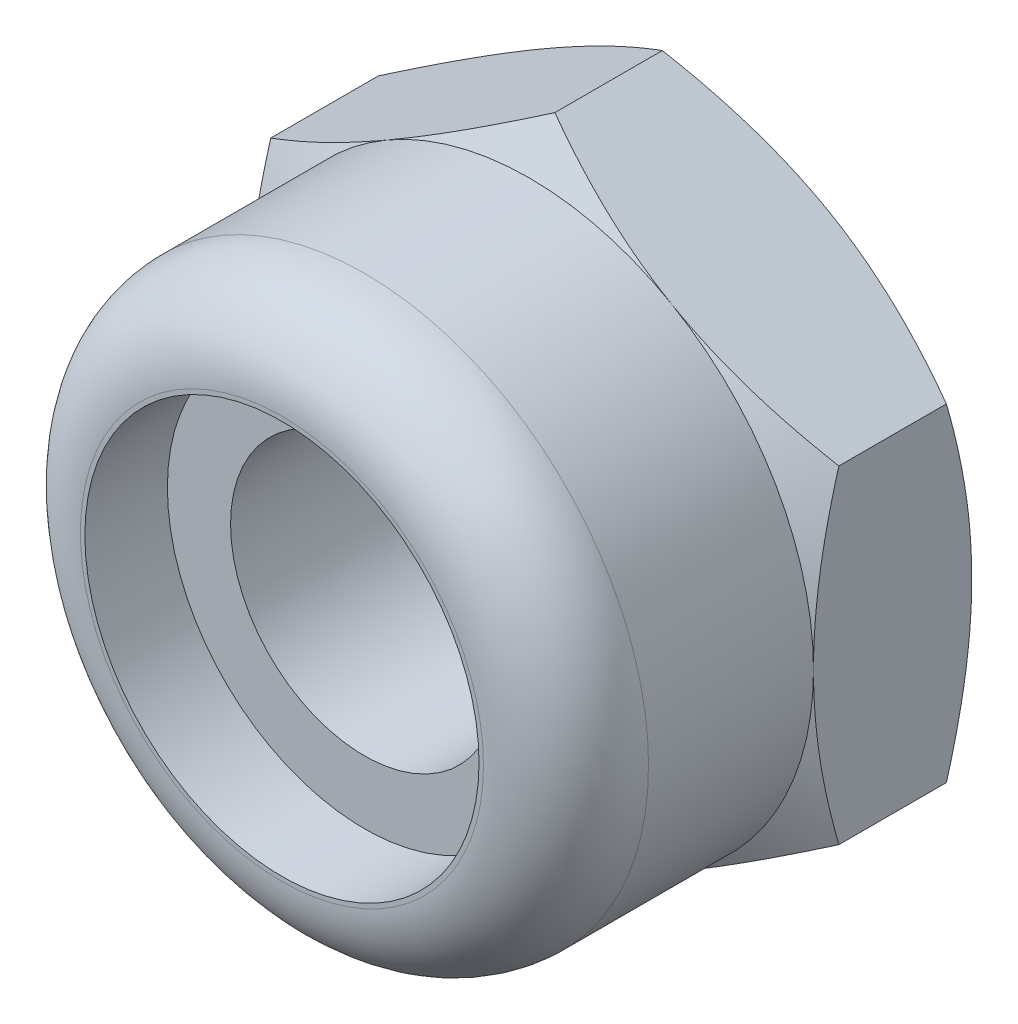
ISO-10303-21;
HEADER;
FILE_DESCRIPTION(('STEP AP214'),'2;1');
FILE_NAME('part.step','',(''),(''),'','','');
FILE_SCHEMA(('AUTOMOTIVE_DESIGN { 1 0 10303 214 1 1 1 1 }'));
ENDSEC;
DATA;
#1=APPLICATION_CONTEXT('core data for automotive mechanical design processes');
#2=APPLICATION_PROTOCOL_DEFINITION('international standard','automotive_design',2000,#1);
#3=PRODUCT_CONTEXT('',#1,'mechanical');
#4=PRODUCT('Part','Part','',(#3));
#5=PRODUCT_RELATED_PRODUCT_CATEGORY('part','',(#4));
#6=PRODUCT_DEFINITION_FORMATION('','',#4);
#7=PRODUCT_DEFINITION_CONTEXT('part definition',#1,'design');
#8=PRODUCT_DEFINITION('design','',#6,#7);
#9=PRODUCT_DEFINITION_SHAPE('','',#8);
#10=(LENGTH_UNIT() NAMED_UNIT(*) SI_UNIT(.MILLI.,.METRE.));
#11=(NAMED_UNIT(*) PLANE_ANGLE_UNIT() SI_UNIT($,.RADIAN.));
#12=(NAMED_UNIT(*) SI_UNIT($,.STERADIAN.) SOLID_ANGLE_UNIT());
#13=UNCERTAINTY_MEASURE_WITH_UNIT(LENGTH_MEASURE(1.E-05),#10,'distance_accuracy_value','');
#14=(GEOMETRIC_REPRESENTATION_CONTEXT(3) GLOBAL_UNCERTAINTY_ASSIGNED_CONTEXT((#13)) GLOBAL_UNIT_ASSIGNED_CONTEXT((#10,
#11,#12)) REPRESENTATION_CONTEXT('',''));
#15=CARTESIAN_POINT('',(0.,0.,0.));
#16=DIRECTION('',(0.,0.,1.));
#17=DIRECTION('',(1.,0.,0.));
#18=AXIS2_PLACEMENT_3D('',#15,#16,#17);
#19=CARTESIAN_POINT('',(0.,0.,-1.95));
#20=DIRECTION('',(0.,0.,1.));
#21=DIRECTION('',(1.,0.,0.));
#22=AXIS2_PLACEMENT_3D('',#19,#20,#21);
#23=CYLINDRICAL_SURFACE('',#22,1.65);
#24=CARTESIAN_POINT('',(0.,0.,2.03333333333333));
#25=DIRECTION('',(0.,0.,1.));
#26=DIRECTION('',(1.,0.,0.));
#27=AXIS2_PLACEMENT_3D('',#24,#25,#26);
#28=CIRCLE('',#27,1.65);
#29=CARTESIAN_POINT('',(1.65,0.,2.03333333333333));
#30=VERTEX_POINT('',#29);
#31=EDGE_CURVE('E262',#30,#30,#28,.T.);
#32=ORIENTED_EDGE('',*,*,#31,.T.);
#33=EDGE_LOOP('',(#32));
#34=FACE_BOUND('',#33,.T.);
#35=CARTESIAN_POINT('',(0.,0.,-1.6795273616266));
#36=DIRECTION('',(0.,0.,-1.));
#37=DIRECTION('',(-1.,0.,0.));
#38=AXIS2_PLACEMENT_3D('',#35,#36,#37);
#39=CIRCLE('',#38,1.65);
#40=CARTESIAN_POINT('',(-1.65,0.,-1.6795273616266));
#41=VERTEX_POINT('',#40);
#42=EDGE_CURVE('E21',#41,#41,#39,.F.);
#43=ORIENTED_EDGE('',*,*,#42,.F.);
#44=EDGE_LOOP('',(#43));
#45=FACE_BOUND('',#44,.T.);
#46=ADVANCED_FACE('F16',(#34,#45),#23,.F.);
#47=CARTESIAN_POINT('',(0.,4.04145188432739,-1.95));
#48=DIRECTION('',(-0.5,0.866025403784437,0.));
#49=DIRECTION('',(-0.866025403784437,-0.5,0.));
#50=AXIS2_PLACEMENT_3D('',#47,#48,#49);
#51=PLANE('',#50);
#52=DIRECTION('',(0.,0.,1.));
#53=VECTOR('',#52,1.);
#54=CARTESIAN_POINT('',(-3.5,2.02072594216368,-1.95));
#55=LINE('',#54,#53);
#56=CARTESIAN_POINT('',(-3.5,2.02072594216372,-1.63739260883035));
#57=VERTEX_POINT('',#56);
#58=CARTESIAN_POINT('',(-3.5,2.02072594216368,-0.312607391169641));
#59=VERTEX_POINT('',#58);
#60=EDGE_CURVE('E235',#57,#59,#55,.T.);
#61=ORIENTED_EDGE('',*,*,#60,.T.);
#62=CARTESIAN_POINT('',(-3.5002,2.02061047210984,-0.312674060693369));
#63=CARTESIAN_POINT('',(-3.34639282154755,2.10941108799267,-0.261385788989985));
#64=CARTESIAN_POINT('',(-3.19125798916558,2.19897822522909,-0.2147409538162));
#65=CARTESIAN_POINT('',(-2.87830199342322,2.37966345361545,-0.133321875533353));
#66=CARTESIAN_POINT('',(-2.72047526921251,2.47078475532382,-0.0985764355845646));
#67=CARTESIAN_POINT('',(-2.40677778961988,2.65189807961074,-0.0444900271828394));
#68=CARTESIAN_POINT('',(-2.25095530083932,2.741862235454,-0.0247890862603857));
#69=CARTESIAN_POINT('',(-1.93857711279463,2.92221386641056,-0.0012701327372566));
#70=CARTESIAN_POINT('',(-1.78202254896577,3.01260068598001,0.00256735545443518));
#71=CARTESIAN_POINT('',(-1.48949078007901,3.18149398149329,-0.00541530187697774));
#72=CARTESIAN_POINT('',(-1.3534697875421,3.26002573814993,-0.0152754340696097));
#73=CARTESIAN_POINT('',(-1.08231397971101,3.41657761679354,-0.0465264668994083));
#74=CARTESIAN_POINT('',(-0.947180102315319,3.49459719728458,-0.0679280432858025));
#75=CARTESIAN_POINT('',(-0.675465207594815,3.6514718648943,-0.121430407880582));
#76=CARTESIAN_POINT('',(-0.538918580721662,3.73030709667645,-0.153757994445092));
#77=CARTESIAN_POINT('',(-0.267861907055493,3.88680174018325,-0.227128933808001));
#78=CARTESIAN_POINT('',(-0.133348387531457,3.9644631568901,-0.268155046569875));
#79=CARTESIAN_POINT('',(0.000200000000009139,4.04156735438123,-0.312674060693379));
#80=B_SPLINE_CURVE_WITH_KNOTS('',3,(#62,#63,#64,#65,#66,#67,#68,#69,#70,#71,#72,#73,#74,#75,#76,
#77,#78,#79),.UNSPECIFIED.,.F.,.F.,(4,2,2,2,2,2,2,2,4),(0.,0.554793832886253,1.11092123814984,
1.65328467083218,2.19498204478403,2.6666513085086,3.13875761298268,3.62133612600511,
4.10296698719189),.UNSPECIFIED.);
#81=CARTESIAN_POINT('',(-1.75,3.03108891324553,0.));
#82=VERTEX_POINT('',#81);
#83=EDGE_CURVE('E41',#59,#82,#80,.T.);
#84=ORIENTED_EDGE('',*,*,#83,.T.);
#85=CARTESIAN_POINT('',(0.,4.04145188432739,-0.312607391169652));
#86=VERTEX_POINT('',#85);
#87=EDGE_CURVE('E184',#82,#86,#80,.T.);
#88=ORIENTED_EDGE('',*,*,#87,.T.);
#89=DIRECTION('',(0.,0.,1.));
#90=VECTOR('',#89,1.);
#91=CARTESIAN_POINT('',(0.,4.04145188432739,-1.95));
#92=LINE('',#91,#90);
#93=CARTESIAN_POINT('',(0.,4.04145188432739,-1.63739260883035));
#94=VERTEX_POINT('',#93);
#95=EDGE_CURVE('E221',#94,#86,#92,.T.);
#96=ORIENTED_EDGE('',*,*,#95,.F.);
#97=CARTESIAN_POINT('',(-3.5002,2.02061047210984,-1.63732593930663));
#98=CARTESIAN_POINT('',(-3.34639282154755,2.10941108799267,-1.68861421101001));
#99=CARTESIAN_POINT('',(-3.19125798916558,2.19897822522909,-1.7352590461838));
#100=CARTESIAN_POINT('',(-2.87830199342323,2.37966345361545,-1.81667812446665));
#101=CARTESIAN_POINT('',(-2.72047526921251,2.47078475532382,-1.85142356441544));
#102=CARTESIAN_POINT('',(-2.40677778961988,2.65189807961074,-1.90550997281716));
#103=CARTESIAN_POINT('',(-2.25095530083932,2.741862235454,-1.92521091373961));
#104=CARTESIAN_POINT('',(-1.93857711279463,2.92221386641056,-1.94872986726274));
#105=CARTESIAN_POINT('',(-1.78202254896577,3.01260068598,-1.95256735545443));
#106=CARTESIAN_POINT('',(-1.48949078007901,3.18149398149329,-1.94458469812302));
#107=CARTESIAN_POINT('',(-1.3534697875421,3.26002573814993,-1.93472456593039));
#108=CARTESIAN_POINT('',(-1.08231397971101,3.41657761679354,-1.90347353310059));
#109=CARTESIAN_POINT('',(-0.947180102315319,3.49459719728458,-1.8820719567142));
#110=CARTESIAN_POINT('',(-0.675465207594814,3.6514718648943,-1.82856959211942));
#111=CARTESIAN_POINT('',(-0.538918580721662,3.73030709667645,-1.79624200555491));
#112=CARTESIAN_POINT('',(-0.267861907055493,3.88680174018325,-1.722871066192));
#113=CARTESIAN_POINT('',(-0.133348387531457,3.9644631568901,-1.68184495343013));
#114=CARTESIAN_POINT('',(0.000200000000009023,4.04156735438123,-1.63732593930662));
#115=B_SPLINE_CURVE_WITH_KNOTS('',3,(#97,#98,#99,#100,#101,#102,#103,#104,#105,#106,#107,#108,
#109,#110,#111,#112,#113,#114),.UNSPECIFIED.,.F.,.F.,(4,2,2,2,2,2,2,2,4),(0.,0.554793832886253,
1.11092123814984,1.65328467083219,2.19498204478403,2.6666513085086,3.13875761298268,
3.62133612600511,4.10296698719189),.UNSPECIFIED.);
#116=CARTESIAN_POINT('',(-1.75,3.03108891324553,-1.95));
#117=VERTEX_POINT('',#116);
#118=EDGE_CURVE('E237',#117,#94,#115,.T.);
#119=ORIENTED_EDGE('',*,*,#118,.F.);
#120=EDGE_CURVE('E215',#57,#117,#115,.T.);
#121=ORIENTED_EDGE('',*,*,#120,.F.);
#122=EDGE_LOOP('',(#61,#84,#88,#96,#119,#121));
#123=FACE_BOUND('',#122,.T.);
#124=ADVANCED_FACE('F18',(#123),#51,.T.);
#125=CARTESIAN_POINT('',(3.5,2.02072594216367,-1.95));
#126=DIRECTION('',(0.500000000000007,0.866025403784435,0.));
#127=DIRECTION('',(-0.866025403784435,0.500000000000007,0.));
#128=AXIS2_PLACEMENT_3D('',#125,#126,#127);
#129=PLANE('',#128);
#130=ORIENTED_EDGE('',*,*,#95,.T.);
#131=CARTESIAN_POINT('',(-0.000199999999990749,4.04156735438123,-0.31267406069338));
#132=CARTESIAN_POINT('',(0.153607178452458,3.95276673849841,-0.26138578898999));
#133=CARTESIAN_POINT('',(0.308742010834432,3.86319960126199,-0.214740953816203));
#134=CARTESIAN_POINT('',(0.621698006576789,3.68251437287563,-0.133321875533352));
#135=CARTESIAN_POINT('',(0.779524730787504,3.59139307116725,-0.0985764355845644));
#136=CARTESIAN_POINT('',(1.09322221038013,3.41027974688034,-0.0444900271828373));
#137=CARTESIAN_POINT('',(1.2490446991607,3.32031559103708,-0.0247890862603817));
#138=CARTESIAN_POINT('',(1.56142288720538,3.13996396008051,-0.00127013273725413));
#139=CARTESIAN_POINT('',(1.71797745103424,3.04957714051106,0.00256735545443432));
#140=CARTESIAN_POINT('',(2.010509219921,2.88068384499777,-0.00541530187697706));
#141=CARTESIAN_POINT('',(2.14653021245791,2.80215208834113,-0.015275434069605));
#142=CARTESIAN_POINT('',(2.417686020289,2.64560020969752,-0.0465264668993998));
#143=CARTESIAN_POINT('',(2.55281989768469,2.56758062920648,-0.0679280432857943));
#144=CARTESIAN_POINT('',(2.82453479240519,2.41070596159677,-0.121430407880573));
#145=CARTESIAN_POINT('',(2.96108141927834,2.33187072981462,-0.153757994445082));
#146=CARTESIAN_POINT('',(3.2321380929445,2.17537608630781,-0.227128933807989));
#147=CARTESIAN_POINT('',(3.36665161246854,2.09771466960097,-0.268155046569862));
#148=CARTESIAN_POINT('',(3.5002,2.02061047210983,-0.312674060693368));
#149=B_SPLINE_CURVE_WITH_KNOTS('',3,(#131,#132,#133,#134,#135,#136,#137,#138,#139,#140,#141,
#142,#143,#144,#145,#146,#147,#148),.UNSPECIFIED.,.F.,.F.,(4,2,2,2,2,2,2,2,4),(0.,
0.554793832886256,1.11092123814984,1.65328467083219,2.19498204478404,2.66665130850861,
3.13875761298268,3.6213361260051,4.10296698719188),.UNSPECIFIED.);
#150=CARTESIAN_POINT('',(1.75000000000002,3.03108891324552,0.));
#151=VERTEX_POINT('',#150);
#152=EDGE_CURVE('E193',#86,#151,#149,.T.);
#153=ORIENTED_EDGE('',*,*,#152,.T.);
#154=CARTESIAN_POINT('',(3.5,2.02072594216371,-0.312607391169652));
#155=VERTEX_POINT('',#154);
#156=EDGE_CURVE('E185',#151,#155,#149,.T.);
#157=ORIENTED_EDGE('',*,*,#156,.T.);
#158=DIRECTION('',(0.,0.,1.));
#159=VECTOR('',#158,1.);
#160=CARTESIAN_POINT('',(3.5,2.02072594216367,-1.95));
#161=LINE('',#160,#159);
#162=CARTESIAN_POINT('',(3.5,2.02072594216371,-1.63739260883035));
#163=VERTEX_POINT('',#162);
#164=EDGE_CURVE('E225',#163,#155,#161,.T.);
#165=ORIENTED_EDGE('',*,*,#164,.F.);
#166=CARTESIAN_POINT('',(-0.000199999999990734,4.04156735438123,-1.63732593930662));
#167=CARTESIAN_POINT('',(0.153607178452458,3.95276673849841,-1.68861421101001));
#168=CARTESIAN_POINT('',(0.308742010834433,3.86319960126199,-1.7352590461838));
#169=CARTESIAN_POINT('',(0.621698006576789,3.68251437287563,-1.81667812446665));
#170=CARTESIAN_POINT('',(0.779524730787504,3.59139307116725,-1.85142356441544));
#171=CARTESIAN_POINT('',(1.09322221038013,3.41027974688034,-1.90550997281716));
#172=CARTESIAN_POINT('',(1.2490446991607,3.32031559103708,-1.92521091373962));
#173=CARTESIAN_POINT('',(1.56142288720538,3.13996396008051,-1.94872986726275));
#174=CARTESIAN_POINT('',(1.71797745103424,3.04957714051106,-1.95256735545443));
#175=CARTESIAN_POINT('',(2.010509219921,2.88068384499777,-1.94458469812302));
#176=CARTESIAN_POINT('',(2.14653021245791,2.80215208834113,-1.93472456593039));
#177=CARTESIAN_POINT('',(2.417686020289,2.64560020969752,-1.9034735331006));
#178=CARTESIAN_POINT('',(2.55281989768469,2.56758062920648,-1.88207195671421));
#179=CARTESIAN_POINT('',(2.82453479240519,2.41070596159677,-1.82856959211943));
#180=CARTESIAN_POINT('',(2.96108141927834,2.33187072981462,-1.79624200555492));
#181=CARTESIAN_POINT('',(3.2321380929445,2.17537608630781,-1.72287106619201));
#182=CARTESIAN_POINT('',(3.36665161246854,2.09771466960097,-1.68184495343014));
#183=CARTESIAN_POINT('',(3.5002,2.02061047210983,-1.63732593930663));
#184=B_SPLINE_CURVE_WITH_KNOTS('',3,(#166,#167,#168,#169,#170,#171,#172,#173,#174,#175,#176,
#177,#178,#179,#180,#181,#182,#183),.UNSPECIFIED.,.F.,.F.,(4,2,2,2,2,2,2,2,4),(0.,
0.554793832886256,1.11092123814984,1.65328467083219,2.19498204478404,2.66665130850861,
3.13875761298268,3.6213361260051,4.10296698719188),.UNSPECIFIED.);
#185=CARTESIAN_POINT('',(1.75000000000002,3.03108891324552,-1.95));
#186=VERTEX_POINT('',#185);
#187=EDGE_CURVE('E206',#186,#163,#184,.T.);
#188=ORIENTED_EDGE('',*,*,#187,.F.);
#189=EDGE_CURVE('E213',#94,#186,#184,.T.);
#190=ORIENTED_EDGE('',*,*,#189,.F.);
#191=EDGE_LOOP('',(#130,#153,#157,#165,#188,#190));
#192=FACE_BOUND('',#191,.T.);
#193=ADVANCED_FACE('F196',(#192),#129,.T.);
#194=CARTESIAN_POINT('',(3.5,2.02072594216367,-1.95));
#195=DIRECTION('',(-1.,0.,0.));
#196=DIRECTION('',(0.,0.,1.));
#197=AXIS2_PLACEMENT_3D('',#194,#195,#196);
#198=PLANE('',#197);
#199=CARTESIAN_POINT('',(3.5,-5.35926299121409,-1.67484346858558));
#200=CARTESIAN_POINT('',(3.5,-5.20559319908845,-1.60058173692105));
#201=CARTESIAN_POINT('',(3.5,-5.05156008083379,-1.52705822833149));
#202=CARTESIAN_POINT('',(3.5,-4.74257074180714,-1.38190950344753));
#203=CARTESIAN_POINT('',(3.5,-4.5876143668244,-1.31028461582134));
#204=CARTESIAN_POINT('',(3.5,-4.27574500225545,-1.16897765517625));
#205=CARTESIAN_POINT('',(3.5,-4.11882589028195,-1.09930904568017));
#206=CARTESIAN_POINT('',(3.5,-3.80369792903858,-0.962964262242773));
#207=CARTESIAN_POINT('',(3.5,-3.64548914750598,-0.896287932319531));
#208=CARTESIAN_POINT('',(3.5,-3.32556618401858,-0.765931819095079));
#209=CARTESIAN_POINT('',(3.5,-3.16383281219927,-0.702298873688876));
#210=CARTESIAN_POINT('',(3.5,-2.838458409456,-0.580016702089503));
#211=CARTESIAN_POINT('',(3.5,-2.67481716858829,-0.521368030370702));
#212=CARTESIAN_POINT('',(3.5,-2.34570278472052,-0.410630279877031));
#213=CARTESIAN_POINT('',(3.5,-2.18023438248745,-0.358527255435866));
#214=CARTESIAN_POINT('',(3.5,-1.84694522806373,-0.262572936976451));
#215=CARTESIAN_POINT('',(3.5,-1.67912523787533,-0.218719033467166));
#216=CARTESIAN_POINT('',(3.5,-1.34101828610928,-0.141391945584794));
#217=CARTESIAN_POINT('',(3.5,-1.17073068027696,-0.107921525211978));
#218=CARTESIAN_POINT('',(3.5,-0.828102385138511,-0.0536149564320535));
#219=CARTESIAN_POINT('',(3.5,-0.655761694017327,-0.0327788191952394));
#220=CARTESIAN_POINT('',(3.5,-0.311020490924473,-0.00558408650575808));
#221=CARTESIAN_POINT('',(3.5,-0.138627397207282,0.000866163165911198));
#222=CARTESIAN_POINT('',(3.5,0.206038074906514,-0.00105355807794603));
#223=CARTESIAN_POINT('',(3.5,0.378310473023159,-0.00941968196343299));
#224=CARTESIAN_POINT('',(3.5,0.672490555822307,-0.0357688927868917));
#225=CARTESIAN_POINT('',(3.5,0.794722791084072,-0.0503206340384192));
#226=CARTESIAN_POINT('',(3.5,1.03824305430558,-0.0859367340533518));
#227=CARTESIAN_POINT('',(3.5,1.15953093025884,-0.107002119926137));
#228=CARTESIAN_POINT('',(3.5,1.52187914771346,-0.178863187081448));
#229=CARTESIAN_POINT('',(3.5,1.7612410421263,-0.238305275622004));
#230=CARTESIAN_POINT('',(3.5,2.11940971387706,-0.340826814402547));
#231=CARTESIAN_POINT('',(3.5,2.24008344316344,-0.377749699085175));
#232=CARTESIAN_POINT('',(3.5,2.48017139213726,-0.455249007699285));
#233=CARTESIAN_POINT('',(3.5,2.5995864179561,-0.49582291166354));
#234=CARTESIAN_POINT('',(3.5,2.83665760451796,-0.579779986782742));
#235=CARTESIAN_POINT('',(3.5,2.95431988203481,-0.623146060034304));
#236=CARTESIAN_POINT('',(3.5,3.18873153508797,-0.712423559566855));
#237=CARTESIAN_POINT('',(3.5,3.30548051959461,-0.758336014592939));
#238=CARTESIAN_POINT('',(3.5,3.42180736613346,-0.805270380724059));
#239=B_SPLINE_CURVE_WITH_KNOTS('',3,(#199,#200,#201,#202,#203,#204,#205,#206,#207,#208,#209,
#210,#211,#212,#213,#214,#215,#216,#217,#218,#219,#220,#221,#222,#223,#224,#225,#226,#227,#228,
#229,#230,#231,#232,#233,#234,#235,#236,#237,#238),.UNSPECIFIED.,.F.,.F.,(4,2,2,2,2,2,2,2,2,2,2,
2,2,2,2,2,2,2,2,4),(0.,0.512025318465739,1.02413870177436,1.53918270315241,2.05419982499224,
2.57553975872799,3.09693761309354,3.61720506610401,4.13730766217538,4.65754858684366,
5.17778997146963,5.69470725122284,6.21149033452402,6.58059623222333,6.94976036239486,
7.68863804939852,8.0671962166048,8.44549507476762,8.821664612801,9.19798724733411),.UNSPECIFIED.);
#240=CARTESIAN_POINT('',(3.5,-2.02072594216373,-0.312607391169652));
#241=VERTEX_POINT('',#240);
#242=CARTESIAN_POINT('',(3.5,0.,0.));
#243=VERTEX_POINT('',#242);
#244=EDGE_CURVE('E172',#241,#243,#239,.T.);
#245=ORIENTED_EDGE('',*,*,#244,.F.);
#246=DIRECTION('',(0.,0.,1.));
#247=VECTOR('',#246,1.);
#248=CARTESIAN_POINT('',(3.5,-2.02072594216372,-1.95));
#249=LINE('',#248,#247);
#250=CARTESIAN_POINT('',(3.5,-2.02072594216373,-1.63739260883035));
#251=VERTEX_POINT('',#250);
#252=EDGE_CURVE('E228',#251,#241,#249,.T.);
#253=ORIENTED_EDGE('',*,*,#252,.F.);
#254=CARTESIAN_POINT('',(3.5,-5.35926299121409,-0.275156531414422));
#255=CARTESIAN_POINT('',(3.5,-5.20559319908845,-0.349418263078947));
#256=CARTESIAN_POINT('',(3.5,-5.05156008083379,-0.422941771668511));
#257=CARTESIAN_POINT('',(3.5,-4.74257074180714,-0.568090496552467));
#258=CARTESIAN_POINT('',(3.5,-4.5876143668244,-0.639715384178658));
#259=CARTESIAN_POINT('',(3.5,-4.27574500225545,-0.781022344823749));
#260=CARTESIAN_POINT('',(3.5,-4.11882589028195,-0.850690954319828));
#261=CARTESIAN_POINT('',(3.5,-3.80369792903859,-0.987035737757227));
#262=CARTESIAN_POINT('',(3.5,-3.64548914750599,-1.05371206768047));
#263=CARTESIAN_POINT('',(3.5,-3.32556618401858,-1.18406818090492));
#264=CARTESIAN_POINT('',(3.5,-3.16383281219927,-1.24770112631112));
#265=CARTESIAN_POINT('',(3.5,-2.838458409456,-1.3699832979105));
#266=CARTESIAN_POINT('',(3.5,-2.67481716858829,-1.4286319696293));
#267=CARTESIAN_POINT('',(3.5,-2.34570278472052,-1.53936972012297));
#268=CARTESIAN_POINT('',(3.5,-2.18023438248746,-1.59147274456413));
#269=CARTESIAN_POINT('',(3.5,-1.84694522806373,-1.68742706302355));
#270=CARTESIAN_POINT('',(3.5,-1.67912523787533,-1.73128096653283));
#271=CARTESIAN_POINT('',(3.5,-1.34101828610928,-1.8086080544152));
#272=CARTESIAN_POINT('',(3.5,-1.17073068027696,-1.84207847478802));
#273=CARTESIAN_POINT('',(3.5,-0.828102385138511,-1.89638504356795));
#274=CARTESIAN_POINT('',(3.5,-0.655761694017327,-1.91722118080476));
#275=CARTESIAN_POINT('',(3.5,-0.311020490924473,-1.94441591349424));
#276=CARTESIAN_POINT('',(3.5,-0.138627397207282,-1.95086616316591));
#277=CARTESIAN_POINT('',(3.5,0.206038074906514,-1.94894644192205));
#278=CARTESIAN_POINT('',(3.5,0.378310473023159,-1.94058031803657));
#279=CARTESIAN_POINT('',(3.5,0.672490555822307,-1.91423110721311));
#280=CARTESIAN_POINT('',(3.5,0.794722791084072,-1.89967936596158));
#281=CARTESIAN_POINT('',(3.5,1.03824305430558,-1.86406326594665));
#282=CARTESIAN_POINT('',(3.5,1.15953093025884,-1.84299788007386));
#283=CARTESIAN_POINT('',(3.5,1.52187914771346,-1.77113681291855));
#284=CARTESIAN_POINT('',(3.5,1.7612410421263,-1.711694724378));
#285=CARTESIAN_POINT('',(3.5,2.11940971387706,-1.60917318559745));
#286=CARTESIAN_POINT('',(3.5,2.24008344316344,-1.57225030091483));
#287=CARTESIAN_POINT('',(3.5,2.48017139213726,-1.49475099230072));
#288=CARTESIAN_POINT('',(3.5,2.5995864179561,-1.45417708833646));
#289=CARTESIAN_POINT('',(3.5,2.83665760451796,-1.37022001321726));
#290=CARTESIAN_POINT('',(3.5,2.95431988203481,-1.3268539399657));
#291=CARTESIAN_POINT('',(3.5,3.18873153508797,-1.23757644043315));
#292=CARTESIAN_POINT('',(3.5,3.30548051959461,-1.19166398540706));
#293=CARTESIAN_POINT('',(3.5,3.42180736613346,-1.14472961927594));
#294=B_SPLINE_CURVE_WITH_KNOTS('',3,(#254,#255,#256,#257,#258,#259,#260,#261,#262,#263,#264,
#265,#266,#267,#268,#269,#270,#271,#272,#273,#274,#275,#276,#277,#278,#279,#280,#281,#282,#283,
#284,#285,#286,#287,#288,#289,#290,#291,#292,#293),.UNSPECIFIED.,.F.,.F.,(4,2,2,2,2,2,2,2,2,2,2,
2,2,2,2,2,2,2,2,4),(0.,0.512025318465738,1.02413870177436,1.53918270315241,2.05419982499224,
2.57553975872798,3.09693761309353,3.61720506610401,4.13730766217538,4.65754858684366,
5.17778997146963,5.69470725122284,6.21149033452402,6.58059623222333,6.94976036239486,
7.68863804939852,8.06719621660479,8.44549507476762,8.821664612801,9.19798724733411),.UNSPECIFIED.);
#295=CARTESIAN_POINT('',(3.5,0.,-1.95));
#296=VERTEX_POINT('',#295);
#297=EDGE_CURVE('E358',#251,#296,#294,.T.);
#298=ORIENTED_EDGE('',*,*,#297,.T.);
#299=EDGE_CURVE('E214',#296,#163,#294,.T.);
#300=ORIENTED_EDGE('',*,*,#299,.T.);
#301=ORIENTED_EDGE('',*,*,#164,.T.);
#302=EDGE_CURVE('E183',#243,#155,#239,.T.);
#303=ORIENTED_EDGE('',*,*,#302,.F.);
#304=EDGE_LOOP('',(#245,#253,#298,#300,#301,#303));
#305=FACE_BOUND('',#304,.T.);
#306=ADVANCED_FACE('F200',(#305),#198,.F.);
#307=CARTESIAN_POINT('',(0.,-4.04145188432743,-1.95));
#308=DIRECTION('',(0.5,-0.866025403784437,0.));
#309=DIRECTION('',(0.866025403784437,0.5,0.));
#310=AXIS2_PLACEMENT_3D('',#307,#308,#309);
#311=PLANE('',#310);
#312=ORIENTED_EDGE('',*,*,#252,.T.);
#313=CARTESIAN_POINT('',(3.5002,-2.02061047210988,-0.312674060693383));
#314=CARTESIAN_POINT('',(3.34639282154755,-2.10941108799271,-0.261385788989999));
#315=CARTESIAN_POINT('',(3.19125798916558,-2.19897822522914,-0.214740953816215));
#316=CARTESIAN_POINT('',(2.87830199342322,-2.3796634536155,-0.133321875533369));
#317=CARTESIAN_POINT('',(2.72047526921251,-2.47078475532387,-0.0985764355845818));
#318=CARTESIAN_POINT('',(2.40677778961988,-2.65189807961078,-0.0444900271828582));
#319=CARTESIAN_POINT('',(2.25095530083931,-2.74186223545404,-0.0247890862604051));
#320=CARTESIAN_POINT('',(1.93857711279463,-2.9222138664106,-0.00127013273727776));
#321=CARTESIAN_POINT('',(1.78202254896577,-3.01260068598005,0.00256735545441286));
#322=CARTESIAN_POINT('',(1.48949078007901,-3.18149398149334,-0.00541530187700159));
#323=CARTESIAN_POINT('',(1.35346978754209,-3.26002573814998,-0.0152754340696339));
#324=CARTESIAN_POINT('',(1.08231397971101,-3.41657761679359,-0.0465264668994331));
#325=CARTESIAN_POINT('',(0.947180102315317,-3.49459719728463,-0.0679280432858276));
#326=CARTESIAN_POINT('',(0.675465207594815,-3.65147186489434,-0.121430407880607));
#327=CARTESIAN_POINT('',(0.538918580721663,-3.73030709667649,-0.153757994445117));
#328=CARTESIAN_POINT('',(0.267861907055497,-3.8868017401833,-0.227128933808026));
#329=CARTESIAN_POINT('',(0.133348387531462,-3.96446315689014,-0.268155046569899));
#330=CARTESIAN_POINT('',(-0.000200000000001401,-4.04156735438127,-0.312674060693403));
#331=B_SPLINE_CURVE_WITH_KNOTS('',3,(#313,#314,#315,#316,#317,#318,#319,#320,#321,#322,#323,
#324,#325,#326,#327,#328,#329,#330),.UNSPECIFIED.,.F.,.F.,(4,2,2,2,2,2,2,2,4),(0.,
0.554793832886255,1.11092123814984,1.65328467083219,2.19498204478404,2.66665130850861,
3.13875761298268,3.6213361260051,4.10296698719188),.UNSPECIFIED.);
#332=CARTESIAN_POINT('',(1.75,-3.03108891324552,0.));
#333=VERTEX_POINT('',#332);
#334=EDGE_CURVE('E352',#241,#333,#331,.T.);
#335=ORIENTED_EDGE('',*,*,#334,.T.);
#336=CARTESIAN_POINT('',(0.,-4.04145188432739,-0.312607391169652));
#337=VERTEX_POINT('',#336);
#338=EDGE_CURVE('E165',#333,#337,#331,.T.);
#339=ORIENTED_EDGE('',*,*,#338,.T.);
#340=DIRECTION('',(0.,0.,1.));
#341=VECTOR('',#340,1.);
#342=CARTESIAN_POINT('',(0.,-4.04145188432743,-1.95));
#343=LINE('',#342,#341);
#344=CARTESIAN_POINT('',(0.,-4.04145188432739,-1.63739260883035));
#345=VERTEX_POINT('',#344);
#346=EDGE_CURVE('E231',#345,#337,#343,.T.);
#347=ORIENTED_EDGE('',*,*,#346,.F.);
#348=CARTESIAN_POINT('',(3.5002,-2.02061047210988,-1.63732593930662));
#349=CARTESIAN_POINT('',(3.34639282154755,-2.10941108799271,-1.68861421101));
#350=CARTESIAN_POINT('',(3.19125798916558,-2.19897822522914,-1.73525904618379));
#351=CARTESIAN_POINT('',(2.87830199342322,-2.3796634536155,-1.81667812446663));
#352=CARTESIAN_POINT('',(2.72047526921251,-2.47078475532387,-1.85142356441542));
#353=CARTESIAN_POINT('',(2.40677778961988,-2.65189807961078,-1.90550997281714));
#354=CARTESIAN_POINT('',(2.25095530083931,-2.74186223545404,-1.92521091373959));
#355=CARTESIAN_POINT('',(1.93857711279463,-2.9222138664106,-1.94872986726272));
#356=CARTESIAN_POINT('',(1.78202254896577,-3.01260068598005,-1.95256735545441));
#357=CARTESIAN_POINT('',(1.48949078007901,-3.18149398149334,-1.944584698123));
#358=CARTESIAN_POINT('',(1.35346978754209,-3.26002573814998,-1.93472456593037));
#359=CARTESIAN_POINT('',(1.08231397971101,-3.41657761679359,-1.90347353310057));
#360=CARTESIAN_POINT('',(0.947180102315317,-3.49459719728463,-1.88207195671417));
#361=CARTESIAN_POINT('',(0.675465207594815,-3.65147186489434,-1.82856959211939));
#362=CARTESIAN_POINT('',(0.538918580721663,-3.73030709667649,-1.79624200555488));
#363=CARTESIAN_POINT('',(0.267861907055496,-3.8868017401833,-1.72287106619197));
#364=CARTESIAN_POINT('',(0.133348387531462,-3.96446315689014,-1.6818449534301));
#365=CARTESIAN_POINT('',(-0.000200000000001409,-4.04156735438127,-1.6373259393066));
#366=B_SPLINE_CURVE_WITH_KNOTS('',3,(#348,#349,#350,#351,#352,#353,#354,#355,#356,#357,#358,
#359,#360,#361,#362,#363,#364,#365),.UNSPECIFIED.,.F.,.F.,(4,2,2,2,2,2,2,2,4),(0.,
0.554793832886254,1.11092123814984,1.65328467083219,2.19498204478404,2.66665130850861,
3.13875761298268,3.62133612600511,4.10296698719188),.UNSPECIFIED.);
#367=CARTESIAN_POINT('',(1.75,-3.03108891324553,-1.95));
#368=VERTEX_POINT('',#367);
#369=EDGE_CURVE('E328',#368,#345,#366,.T.);
#370=ORIENTED_EDGE('',*,*,#369,.F.);
#371=EDGE_CURVE('E354',#251,#368,#366,.T.);
#372=ORIENTED_EDGE('',*,*,#371,.F.);
#373=EDGE_LOOP('',(#312,#335,#339,#347,#370,#372));
#374=FACE_BOUND('',#373,.T.);
#375=ADVANCED_FACE('F336',(#374),#311,.T.);
#376=CARTESIAN_POINT('',(-3.5,-2.02072594216371,-1.95));
#377=DIRECTION('',(-0.500000000000006,-0.866025403784435,0.));
#378=DIRECTION('',(0.866025403784435,-0.500000000000006,0.));
#379=AXIS2_PLACEMENT_3D('',#376,#377,#378);
#380=PLANE('',#379);
#381=ORIENTED_EDGE('',*,*,#346,.T.);
#382=CARTESIAN_POINT('',(0.000199999999998716,-4.04156735438127,-0.312674060693404));
#383=CARTESIAN_POINT('',(-0.153607178452453,-3.95276673849845,-0.261385788990015));
#384=CARTESIAN_POINT('',(-0.308742010834428,-3.86319960126203,-0.214740953816227));
#385=CARTESIAN_POINT('',(-0.621698006576788,-3.68251437287567,-0.133321875533377));
#386=CARTESIAN_POINT('',(-0.779524730787504,-3.59139307116729,-0.0985764355845882));
#387=CARTESIAN_POINT('',(-1.09322221038014,-3.41027974688038,-0.0444900271828605));
#388=CARTESIAN_POINT('',(-1.2490446991607,-3.32031559103712,-0.0247890862604047));
#389=CARTESIAN_POINT('',(-1.56142288720539,-3.13996396008055,-0.00127013273727516));
#390=CARTESIAN_POINT('',(-1.71797745103425,-3.04957714051109,0.00256735545441514));
#391=CARTESIAN_POINT('',(-2.01050921992101,-2.8806838449978,-0.00541530187699614));
#392=CARTESIAN_POINT('',(-2.14653021245792,-2.80215208834117,-0.0152754340696252));
#393=CARTESIAN_POINT('',(-2.41768602028901,-2.64560020969756,-0.0465264668994201));
#394=CARTESIAN_POINT('',(-2.55281989768469,-2.56758062920652,-0.0679280432858135));
#395=CARTESIAN_POINT('',(-2.82453479240519,-2.41070596159681,-0.12143040788059));
#396=CARTESIAN_POINT('',(-2.96108141927834,-2.33187072981466,-0.153757994445099));
#397=CARTESIAN_POINT('',(-3.23213809294451,-2.17537608630785,-0.227128933808004));
#398=CARTESIAN_POINT('',(-3.36665161246854,-2.09771466960101,-0.268155046569875));
#399=CARTESIAN_POINT('',(-3.5002,-2.02061047210988,-0.312674060693378));
#400=B_SPLINE_CURVE_WITH_KNOTS('',3,(#382,#383,#384,#385,#386,#387,#388,#389,#390,#391,#392,
#393,#394,#395,#396,#397,#398,#399),.UNSPECIFIED.,.F.,.F.,(4,2,2,2,2,2,2,2,4),(0.,
0.554793832886261,1.11092123814985,1.65328467083221,2.19498204478406,2.66665130850862,
3.13875761298269,3.62133612600512,4.10296698719189),.UNSPECIFIED.);
#401=CARTESIAN_POINT('',(-1.75,-3.03108891324552,0.));
#402=VERTEX_POINT('',#401);
#403=EDGE_CURVE('E132',#337,#402,#400,.T.);
#404=ORIENTED_EDGE('',*,*,#403,.T.);
#405=CARTESIAN_POINT('',(-3.5,-2.02072594216372,-0.312607391169652));
#406=VERTEX_POINT('',#405);
#407=EDGE_CURVE('E123',#402,#406,#400,.T.);
#408=ORIENTED_EDGE('',*,*,#407,.T.);
#409=DIRECTION('',(0.,0.,1.));
#410=VECTOR('',#409,1.);
#411=CARTESIAN_POINT('',(-3.5,-2.02072594216371,-1.95));
#412=LINE('',#411,#410);
#413=CARTESIAN_POINT('',(-3.5,-2.02072594216372,-1.63739260883035));
#414=VERTEX_POINT('',#413);
#415=EDGE_CURVE('E131',#414,#406,#412,.T.);
#416=ORIENTED_EDGE('',*,*,#415,.F.);
#417=CARTESIAN_POINT('',(0.00019999999999873,-4.04156735438127,-1.6373259393066));
#418=CARTESIAN_POINT('',(-0.153607178452452,-3.95276673849845,-1.68861421100998));
#419=CARTESIAN_POINT('',(-0.308742010834428,-3.86319960126203,-1.73525904618377));
#420=CARTESIAN_POINT('',(-0.621698006576788,-3.68251437287567,-1.81667812446662));
#421=CARTESIAN_POINT('',(-0.779524730787504,-3.59139307116729,-1.85142356441541));
#422=CARTESIAN_POINT('',(-1.09322221038014,-3.41027974688038,-1.90550997281714));
#423=CARTESIAN_POINT('',(-1.2490446991607,-3.32031559103712,-1.92521091373959));
#424=CARTESIAN_POINT('',(-1.56142288720539,-3.13996396008055,-1.94872986726273));
#425=CARTESIAN_POINT('',(-1.71797745103425,-3.04957714051109,-1.95256735545442));
#426=CARTESIAN_POINT('',(-2.01050921992101,-2.8806838449978,-1.94458469812301));
#427=CARTESIAN_POINT('',(-2.14653021245792,-2.80215208834117,-1.93472456593038));
#428=CARTESIAN_POINT('',(-2.41768602028901,-2.64560020969756,-1.90347353310058));
#429=CARTESIAN_POINT('',(-2.55281989768469,-2.56758062920652,-1.88207195671419));
#430=CARTESIAN_POINT('',(-2.82453479240519,-2.41070596159681,-1.82856959211941));
#431=CARTESIAN_POINT('',(-2.96108141927834,-2.33187072981466,-1.7962420055549));
#432=CARTESIAN_POINT('',(-3.23213809294451,-2.17537608630785,-1.722871066192));
#433=CARTESIAN_POINT('',(-3.36665161246854,-2.09771466960101,-1.68184495343012));
#434=CARTESIAN_POINT('',(-3.5002,-2.02061047210988,-1.63732593930662));
#435=B_SPLINE_CURVE_WITH_KNOTS('',3,(#417,#418,#419,#420,#421,#422,#423,#424,#425,#426,#427,
#428,#429,#430,#431,#432,#433,#434),.UNSPECIFIED.,.F.,.F.,(4,2,2,2,2,2,2,2,4),(0.,
0.554793832886261,1.11092123814985,1.65328467083221,2.19498204478406,2.66665130850863,
3.13875761298269,3.62133612600512,4.10296698719189),.UNSPECIFIED.);
#436=CARTESIAN_POINT('',(-1.75,-3.03108891324552,-1.95));
#437=VERTEX_POINT('',#436);
#438=EDGE_CURVE('E315',#437,#414,#435,.T.);
#439=ORIENTED_EDGE('',*,*,#438,.F.);
#440=EDGE_CURVE('E327',#345,#437,#435,.T.);
#441=ORIENTED_EDGE('',*,*,#440,.F.);
#442=EDGE_LOOP('',(#381,#404,#408,#416,#439,#441));
#443=FACE_BOUND('',#442,.T.);
#444=ADVANCED_FACE('F333',(#443),#380,.T.);
#445=CARTESIAN_POINT('',(-3.5,2.02072594216368,-1.95));
#446=DIRECTION('',(-1.,0.,0.));
#447=DIRECTION('',(0.,0.,1.));
#448=AXIS2_PLACEMENT_3D('',#445,#446,#447);
#449=PLANE('',#448);
#450=ORIENTED_EDGE('',*,*,#415,.T.);
#451=CARTESIAN_POINT('',(-3.5,-5.35926299121408,-1.67484346858557));
#452=CARTESIAN_POINT('',(-3.5,-5.20559319908844,-1.60058173692105));
#453=CARTESIAN_POINT('',(-3.5,-5.05156008083378,-1.52705822833148));
#454=CARTESIAN_POINT('',(-3.5,-4.74257074180712,-1.38190950344753));
#455=CARTESIAN_POINT('',(-3.5,-4.58761436682439,-1.31028461582134));
#456=CARTESIAN_POINT('',(-3.5,-4.27574500225545,-1.16897765517625));
#457=CARTESIAN_POINT('',(-3.5,-4.11882589028194,-1.09930904568017));
#458=CARTESIAN_POINT('',(-3.5,-3.80369792903858,-0.96296426224277));
#459=CARTESIAN_POINT('',(-3.5,-3.64548914750598,-0.896287932319527));
#460=CARTESIAN_POINT('',(-3.5,-3.32556618401858,-0.765931819095075));
#461=CARTESIAN_POINT('',(-3.5,-3.16383281219926,-0.702298873688873));
#462=CARTESIAN_POINT('',(-3.5,-2.838458409456,-0.5800167020895));
#463=CARTESIAN_POINT('',(-3.5,-2.67481716858828,-0.521368030370698));
#464=CARTESIAN_POINT('',(-3.5,-2.34570278472051,-0.410630279877028));
#465=CARTESIAN_POINT('',(-3.5,-2.18023438248744,-0.358527255435863));
#466=CARTESIAN_POINT('',(-3.5,-1.84694522806372,-0.262572936976448));
#467=CARTESIAN_POINT('',(-3.5,-1.67912523787532,-0.218719033467163));
#468=CARTESIAN_POINT('',(-3.5,-1.34101828610927,-0.14139194558479));
#469=CARTESIAN_POINT('',(-3.5,-1.17073068027695,-0.107921525211976));
#470=CARTESIAN_POINT('',(-3.5,-0.828102385138502,-0.0536149564320528));
#471=CARTESIAN_POINT('',(-3.5,-0.655761694017319,-0.0327788191952384));
#472=CARTESIAN_POINT('',(-3.5,-0.311020490924466,-0.00558408650575762));
#473=CARTESIAN_POINT('',(-3.5,-0.138627397207275,0.000866163165910831));
#474=CARTESIAN_POINT('',(-3.5,0.20603807490652,-0.00105355807794567));
#475=CARTESIAN_POINT('',(-3.5,0.378310473023165,-0.00941968196343104));
#476=CARTESIAN_POINT('',(-3.5,0.672490555822312,-0.0357688927868905));
#477=CARTESIAN_POINT('',(-3.5,0.794722791084076,-0.0503206340384195));
#478=CARTESIAN_POINT('',(-3.5,1.03824305430558,-0.085936734053353));
#479=CARTESIAN_POINT('',(-3.5,1.15953093025885,-0.107002119926138));
#480=CARTESIAN_POINT('',(-3.5,1.52187914771346,-0.178863187081448));
#481=CARTESIAN_POINT('',(-3.5,1.7612410421263,-0.238305275622005));
#482=CARTESIAN_POINT('',(-3.5,2.11940971387706,-0.340826814402548));
#483=CARTESIAN_POINT('',(-3.5,2.24008344316344,-0.377749699085176));
#484=CARTESIAN_POINT('',(-3.5,2.48017139213726,-0.455249007699286));
#485=CARTESIAN_POINT('',(-3.5,2.59958641795611,-0.495822911663542));
#486=CARTESIAN_POINT('',(-3.5,2.83665760451796,-0.579779986782744));
#487=CARTESIAN_POINT('',(-3.5,2.95431988203481,-0.623146060034306));
#488=CARTESIAN_POINT('',(-3.5,3.18873153508798,-0.712423559566857));
#489=CARTESIAN_POINT('',(-3.5,3.30548051959462,-0.75833601459294));
#490=CARTESIAN_POINT('',(-3.5,3.42180736613347,-0.805270380724061));
#491=B_SPLINE_CURVE_WITH_KNOTS('',3,(#451,#452,#453,#454,#455,#456,#457,#458,#459,#460,#461,
#462,#463,#464,#465,#466,#467,#468,#469,#470,#471,#472,#473,#474,#475,#476,#477,#478,#479,#480,
#481,#482,#483,#484,#485,#486,#487,#488,#489,#490),.UNSPECIFIED.,.F.,.F.,(4,2,2,2,2,2,2,2,2,2,2,
2,2,2,2,2,2,2,2,4),(0.,0.512025318465738,1.02413870177436,1.53918270315241,2.05419982499223,
2.57553975872798,3.09693761309353,3.61720506610401,4.13730766217538,4.65754858684365,
5.17778997146962,5.69470725122283,6.21149033452402,6.58059623222332,6.94976036239485,
7.68863804939851,8.06719621660479,8.44549507476761,8.82166461280099,9.1979872473341),.UNSPECIFIED.);
#492=CARTESIAN_POINT('',(-3.5,0.,0.));
#493=VERTEX_POINT('',#492);
#494=EDGE_CURVE('E116',#406,#493,#491,.T.);
#495=ORIENTED_EDGE('',*,*,#494,.T.);
#496=EDGE_CURVE('E110',#493,#59,#491,.T.);
#497=ORIENTED_EDGE('',*,*,#496,.T.);
#498=ORIENTED_EDGE('',*,*,#60,.F.);
#499=CARTESIAN_POINT('',(-3.5,-5.35926299121408,-0.275156531414431));
#500=CARTESIAN_POINT('',(-3.5,-5.20559319908844,-0.349418263078955));
#501=CARTESIAN_POINT('',(-3.5,-5.05156008083378,-0.422941771668518));
#502=CARTESIAN_POINT('',(-3.5,-4.74257074180712,-0.568090496552472));
#503=CARTESIAN_POINT('',(-3.5,-4.58761436682439,-0.639715384178663));
#504=CARTESIAN_POINT('',(-3.5,-4.27574500225544,-0.781022344823753));
#505=CARTESIAN_POINT('',(-3.5,-4.11882589028194,-0.850690954319833));
#506=CARTESIAN_POINT('',(-3.5,-3.80369792903857,-0.987035737757231));
#507=CARTESIAN_POINT('',(-3.5,-3.64548914750597,-1.05371206768047));
#508=CARTESIAN_POINT('',(-3.5,-3.32556618401857,-1.18406818090492));
#509=CARTESIAN_POINT('',(-3.5,-3.16383281219926,-1.24770112631113));
#510=CARTESIAN_POINT('',(-3.5,-2.83845840945599,-1.3699832979105));
#511=CARTESIAN_POINT('',(-3.5,-2.67481716858828,-1.4286319696293));
#512=CARTESIAN_POINT('',(-3.5,-2.34570278472051,-1.53936972012297));
#513=CARTESIAN_POINT('',(-3.5,-2.18023438248744,-1.59147274456414));
#514=CARTESIAN_POINT('',(-3.5,-1.84694522806372,-1.68742706302355));
#515=CARTESIAN_POINT('',(-3.5,-1.67912523787532,-1.73128096653284));
#516=CARTESIAN_POINT('',(-3.5,-1.34101828610927,-1.80860805441521));
#517=CARTESIAN_POINT('',(-3.5,-1.17073068027695,-1.84207847478802));
#518=CARTESIAN_POINT('',(-3.5,-0.828102385138502,-1.89638504356795));
#519=CARTESIAN_POINT('',(-3.5,-0.655761694017319,-1.91722118080476));
#520=CARTESIAN_POINT('',(-3.5,-0.311020490924466,-1.94441591349424));
#521=CARTESIAN_POINT('',(-3.5,-0.138627397207276,-1.95086616316591));
#522=CARTESIAN_POINT('',(-3.5,0.206038074906519,-1.94894644192205));
#523=CARTESIAN_POINT('',(-3.5,0.378310473023164,-1.94058031803657));
#524=CARTESIAN_POINT('',(-3.5,0.672490555822312,-1.91423110721311));
#525=CARTESIAN_POINT('',(-3.5,0.794722791084076,-1.89967936596158));
#526=CARTESIAN_POINT('',(-3.5,1.03824305430558,-1.86406326594665));
#527=CARTESIAN_POINT('',(-3.5,1.15953093025885,-1.84299788007386));
#528=CARTESIAN_POINT('',(-3.5,1.52187914771346,-1.77113681291855));
#529=CARTESIAN_POINT('',(-3.5,1.7612410421263,-1.711694724378));
#530=CARTESIAN_POINT('',(-3.5,2.11940971387706,-1.60917318559745));
#531=CARTESIAN_POINT('',(-3.5,2.24008344316344,-1.57225030091482));
#532=CARTESIAN_POINT('',(-3.5,2.48017139213726,-1.49475099230071));
#533=CARTESIAN_POINT('',(-3.5,2.59958641795611,-1.45417708833646));
#534=CARTESIAN_POINT('',(-3.5,2.83665760451796,-1.37022001321726));
#535=CARTESIAN_POINT('',(-3.5,2.95431988203481,-1.3268539399657));
#536=CARTESIAN_POINT('',(-3.5,3.18873153508798,-1.23757644043314));
#537=CARTESIAN_POINT('',(-3.5,3.30548051959462,-1.19166398540706));
#538=CARTESIAN_POINT('',(-3.5,3.42180736613347,-1.14472961927594));
#539=B_SPLINE_CURVE_WITH_KNOTS('',3,(#499,#500,#501,#502,#503,#504,#505,#506,#507,#508,#509,
#510,#511,#512,#513,#514,#515,#516,#517,#518,#519,#520,#521,#522,#523,#524,#525,#526,#527,#528,
#529,#530,#531,#532,#533,#534,#535,#536,#537,#538),.UNSPECIFIED.,.F.,.F.,(4,2,2,2,2,2,2,2,2,2,2,
2,2,2,2,2,2,2,2,4),(0.,0.512025318465738,1.02413870177436,1.53918270315241,2.05419982499224,
2.57553975872798,3.09693761309353,3.61720506610401,4.13730766217538,4.65754858684365,
5.17778997146962,5.69470725122283,6.21149033452402,6.58059623222332,6.94976036239485,
7.68863804939852,8.06719621660479,8.44549507476761,8.82166461280099,9.1979872473341),.UNSPECIFIED.);
#540=CARTESIAN_POINT('',(-3.5,0.,-1.95));
#541=VERTEX_POINT('',#540);
#542=EDGE_CURVE('E311',#541,#57,#539,.T.);
#543=ORIENTED_EDGE('',*,*,#542,.F.);
#544=EDGE_CURVE('E313',#414,#541,#539,.T.);
#545=ORIENTED_EDGE('',*,*,#544,.F.);
#546=EDGE_LOOP('',(#450,#495,#497,#498,#543,#545));
#547=FACE_BOUND('',#546,.T.);
#548=ADVANCED_FACE('F128',(#547),#449,.T.);
#549=CARTESIAN_POINT('',(0.,4.04145188432739,-1.95));
#550=DIRECTION('',(0.,0.,-1.));
#551=DIRECTION('',(-1.,0.,0.));
#552=AXIS2_PLACEMENT_3D('',#549,#550,#551);
#553=PLANE('',#552);
#554=CARTESIAN_POINT('',(0.,0.,-1.95));
#555=DIRECTION('',(0.,0.,-1.));
#556=DIRECTION('',(-1.,0.,0.));
#557=AXIS2_PLACEMENT_3D('',#554,#555,#556);
#558=CIRCLE('',#557,2.);
#559=CARTESIAN_POINT('',(-2.,0.,-1.95));
#560=VERTEX_POINT('',#559);
#561=EDGE_CURVE('E240',#560,#560,#558,.F.);
#562=ORIENTED_EDGE('',*,*,#561,.T.);
#563=EDGE_LOOP('',(#562));
#564=FACE_BOUND('',#563,.T.);
#565=CARTESIAN_POINT('',(0.,0.,-1.95));
#566=DIRECTION('',(0.,0.,-1.));
#567=DIRECTION('',(-1.,0.,0.));
#568=AXIS2_PLACEMENT_3D('',#565,#566,#567);
#569=CIRCLE('',#568,3.5);
#570=EDGE_CURVE('E126',#541,#437,#569,.F.);
#571=ORIENTED_EDGE('',*,*,#570,.F.);
#572=EDGE_CURVE('E224',#117,#541,#569,.F.);
#573=ORIENTED_EDGE('',*,*,#572,.F.);
#574=EDGE_CURVE('E239',#186,#117,#569,.F.);
#575=ORIENTED_EDGE('',*,*,#574,.F.);
#576=CARTESIAN_POINT('',(0.,0.,-1.95));
#577=DIRECTION('',(0.,0.,1.));
#578=DIRECTION('',(1.,0.,0.));
#579=AXIS2_PLACEMENT_3D('',#576,#577,#578);
#580=CIRCLE('',#579,3.5);
#581=EDGE_CURVE('E194',#296,#186,#580,.T.);
#582=ORIENTED_EDGE('',*,*,#581,.F.);
#583=EDGE_CURVE('E391',#368,#296,#569,.F.);
#584=ORIENTED_EDGE('',*,*,#583,.F.);
#585=EDGE_CURVE('E383',#437,#368,#569,.F.);
#586=ORIENTED_EDGE('',*,*,#585,.F.);
#587=EDGE_LOOP('',(#571,#573,#575,#582,#584,#586));
#588=FACE_BOUND('',#587,.T.);
#589=ADVANCED_FACE('F202',(#564,#588),#553,.T.);
#590=CARTESIAN_POINT('',(0.,0.,-1.95));
#591=DIRECTION('',(0.,0.,1.));
#592=DIRECTION('',(1.,0.,0.));
#593=AXIS2_PLACEMENT_3D('',#590,#591,#592);
#594=CONICAL_SURFACE('',#593,3.5,1.0471975511966);
#595=ORIENTED_EDGE('',*,*,#120,.T.);
#596=ORIENTED_EDGE('',*,*,#572,.T.);
#597=ORIENTED_EDGE('',*,*,#542,.T.);
#598=EDGE_LOOP('',(#595,#596,#597));
#599=FACE_BOUND('',#598,.T.);
#600=ADVANCED_FACE('F402',(#599),#594,.T.);
#601=ORIENTED_EDGE('',*,*,#118,.T.);
#602=ORIENTED_EDGE('',*,*,#189,.T.);
#603=ORIENTED_EDGE('',*,*,#574,.T.);
#604=EDGE_LOOP('',(#601,#602,#603));
#605=FACE_BOUND('',#604,.T.);
#606=ADVANCED_FACE('F400',(#605),#594,.T.);
#607=ORIENTED_EDGE('',*,*,#187,.T.);
#608=ORIENTED_EDGE('',*,*,#299,.F.);
#609=ORIENTED_EDGE('',*,*,#581,.T.);
#610=EDGE_LOOP('',(#607,#608,#609));
#611=FACE_BOUND('',#610,.T.);
#612=ADVANCED_FACE('F410',(#611),#594,.T.);
#613=ORIENTED_EDGE('',*,*,#371,.T.);
#614=ORIENTED_EDGE('',*,*,#583,.T.);
#615=ORIENTED_EDGE('',*,*,#297,.F.);
#616=EDGE_LOOP('',(#613,#614,#615));
#617=FACE_BOUND('',#616,.T.);
#618=ADVANCED_FACE('F404',(#617),#594,.T.);
#619=ORIENTED_EDGE('',*,*,#369,.T.);
#620=ORIENTED_EDGE('',*,*,#440,.T.);
#621=ORIENTED_EDGE('',*,*,#585,.T.);
#622=EDGE_LOOP('',(#619,#620,#621));
#623=FACE_BOUND('',#622,.T.);
#624=ADVANCED_FACE('F381',(#623),#594,.T.);
#625=ORIENTED_EDGE('',*,*,#438,.T.);
#626=ORIENTED_EDGE('',*,*,#544,.T.);
#627=ORIENTED_EDGE('',*,*,#570,.T.);
#628=EDGE_LOOP('',(#625,#626,#627));
#629=FACE_BOUND('',#628,.T.);
#630=ADVANCED_FACE('F153',(#629),#594,.T.);
#631=CARTESIAN_POINT('',(0.,0.,0.));
#632=DIRECTION('',(0.,0.,-1.));
#633=DIRECTION('',(-1.,0.,0.));
#634=AXIS2_PLACEMENT_3D('',#631,#632,#633);
#635=CONICAL_SURFACE('',#634,3.5,1.0471975511966);
#636=CARTESIAN_POINT('',(0.,0.,0.));
#637=DIRECTION('',(0.,0.,-1.));
#638=DIRECTION('',(-1.,0.,0.));
#639=AXIS2_PLACEMENT_3D('',#636,#637,#638);
#640=CIRCLE('',#639,3.5);
#641=EDGE_CURVE('E28',#402,#493,#640,.T.);
#642=ORIENTED_EDGE('',*,*,#641,.T.);
#643=ORIENTED_EDGE('',*,*,#494,.F.);
#644=ORIENTED_EDGE('',*,*,#407,.F.);
#645=EDGE_LOOP('',(#642,#643,#644));
#646=FACE_BOUND('',#645,.T.);
#647=ADVANCED_FACE('F121',(#646),#635,.T.);
#648=EDGE_CURVE('E125',#333,#402,#640,.T.);
#649=ORIENTED_EDGE('',*,*,#648,.T.);
#650=ORIENTED_EDGE('',*,*,#403,.F.);
#651=ORIENTED_EDGE('',*,*,#338,.F.);
#652=EDGE_LOOP('',(#649,#650,#651));
#653=FACE_BOUND('',#652,.T.);
#654=ADVANCED_FACE('F152',(#653),#635,.T.);
#655=ORIENTED_EDGE('',*,*,#244,.T.);
#656=EDGE_CURVE('E394',#243,#333,#640,.T.);
#657=ORIENTED_EDGE('',*,*,#656,.T.);
#658=ORIENTED_EDGE('',*,*,#334,.F.);
#659=EDGE_LOOP('',(#655,#657,#658));
#660=FACE_BOUND('',#659,.T.);
#661=ADVANCED_FACE('F395',(#660),#635,.T.);
#662=CARTESIAN_POINT('',(0.,0.,0.));
#663=DIRECTION('',(0.,0.,1.));
#664=DIRECTION('',(1.,0.,0.));
#665=AXIS2_PLACEMENT_3D('',#662,#663,#664);
#666=CIRCLE('',#665,3.5);
#667=EDGE_CURVE('E117',#243,#151,#666,.T.);
#668=ORIENTED_EDGE('',*,*,#667,.F.);
#669=ORIENTED_EDGE('',*,*,#302,.T.);
#670=ORIENTED_EDGE('',*,*,#156,.F.);
#671=EDGE_LOOP('',(#668,#669,#670));
#672=FACE_BOUND('',#671,.T.);
#673=ADVANCED_FACE('F366',(#672),#635,.T.);
#674=EDGE_CURVE('E26',#82,#151,#640,.T.);
#675=ORIENTED_EDGE('',*,*,#674,.T.);
#676=ORIENTED_EDGE('',*,*,#152,.F.);
#677=ORIENTED_EDGE('',*,*,#87,.F.);
#678=EDGE_LOOP('',(#675,#676,#677));
#679=FACE_BOUND('',#678,.T.);
#680=ADVANCED_FACE('F154',(#679),#635,.T.);
#681=ORIENTED_EDGE('',*,*,#496,.F.);
#682=EDGE_CURVE('E10',#493,#82,#640,.T.);
#683=ORIENTED_EDGE('',*,*,#682,.T.);
#684=ORIENTED_EDGE('',*,*,#83,.F.);
#685=EDGE_LOOP('',(#681,#683,#684));
#686=FACE_BOUND('',#685,.T.);
#687=ADVANCED_FACE('F111',(#686),#635,.T.);
#688=CARTESIAN_POINT('',(0.,0.,-1.9246));
#689=DIRECTION('',(0.,0.,-1.));
#690=DIRECTION('',(-1.,0.,0.));
#691=AXIS2_PLACEMENT_3D('',#688,#689,#690);
#692=CONICAL_SURFACE('',#691,2.,0.959931088596873);
#693=CARTESIAN_POINT('',(0.,0.,-1.9246));
#694=DIRECTION('',(0.,0.,1.));
#695=DIRECTION('',(1.,0.,0.));
#696=AXIS2_PLACEMENT_3D('',#693,#694,#695);
#697=CIRCLE('',#696,2.);
#698=CARTESIAN_POINT('',(2.,0.,-1.9246));
#699=VERTEX_POINT('',#698);
#700=EDGE_CURVE('E242',#699,#699,#697,.T.);
#701=ORIENTED_EDGE('',*,*,#700,.F.);
#702=EDGE_LOOP('',(#701));
#703=FACE_BOUND('',#702,.T.);
#704=ORIENTED_EDGE('',*,*,#42,.T.);
#705=EDGE_LOOP('',(#704));
#706=FACE_BOUND('',#705,.T.);
#707=ADVANCED_FACE('F498',(#703,#706),#692,.F.);
#708=CARTESIAN_POINT('',(0.,0.,19.05));
#709=DIRECTION('',(0.,0.,1.));
#710=DIRECTION('',(1.,0.,0.));
#711=AXIS2_PLACEMENT_3D('',#708,#709,#710);
#712=CYLINDRICAL_SURFACE('',#711,2.);
#713=ORIENTED_EDGE('',*,*,#561,.F.);
#714=EDGE_LOOP('',(#713));
#715=FACE_BOUND('',#714,.T.);
#716=ORIENTED_EDGE('',*,*,#700,.T.);
#717=EDGE_LOOP('',(#716));
#718=FACE_BOUND('',#717,.T.);
#719=ADVANCED_FACE('F155',(#715,#718),#712,.F.);
#720=CARTESIAN_POINT('',(0.,1.65,2.03333333333333));
#721=DIRECTION('',(0.,0.,-1.));
#722=DIRECTION('',(-1.,0.,0.));
#723=AXIS2_PLACEMENT_3D('',#720,#721,#722);
#724=PLANE('',#723);
#725=ORIENTED_EDGE('',*,*,#31,.F.);
#726=EDGE_LOOP('',(#725));
#727=FACE_BOUND('',#726,.T.);
#728=CARTESIAN_POINT('',(0.,0.,2.03333333333333));
#729=DIRECTION('',(0.,0.,1.));
#730=DIRECTION('',(1.,0.,0.));
#731=AXIS2_PLACEMENT_3D('',#728,#729,#730);
#732=CIRCLE('',#731,2.42857142857143);
#733=CARTESIAN_POINT('',(2.42857142857143,0.,2.03333333333333));
#734=VERTEX_POINT('',#733);
#735=EDGE_CURVE('E247',#734,#734,#732,.T.);
#736=ORIENTED_EDGE('',*,*,#735,.T.);
#737=EDGE_LOOP('',(#736));
#738=FACE_BOUND('',#737,.T.);
#739=ADVANCED_FACE('F268',(#727,#738),#724,.F.);
#740=CARTESIAN_POINT('',(0.,0.,9.48088822457563));
#741=DIRECTION('',(0.,0.,1.));
#742=DIRECTION('',(1.,0.,0.));
#743=AXIS2_PLACEMENT_3D('',#740,#741,#742);
#744=CYLINDRICAL_SURFACE('',#743,2.42857142857143);
#745=ORIENTED_EDGE('',*,*,#735,.F.);
#746=EDGE_LOOP('',(#745));
#747=FACE_BOUND('',#746,.T.);
#748=CARTESIAN_POINT('',(0.,0.,3.05));
#749=DIRECTION('',(0.,0.,1.));
#750=DIRECTION('',(1.,0.,0.));
#751=AXIS2_PLACEMENT_3D('',#748,#749,#750);
#752=CIRCLE('',#751,2.42857142857143);
#753=CARTESIAN_POINT('',(2.42857142857143,0.,3.05));
#754=VERTEX_POINT('',#753);
#755=EDGE_CURVE('E251',#754,#754,#752,.T.);
#756=ORIENTED_EDGE('',*,*,#755,.T.);
#757=EDGE_LOOP('',(#756));
#758=FACE_BOUND('',#757,.T.);
#759=ADVANCED_FACE('F271',(#747,#758),#744,.F.);
#760=CARTESIAN_POINT('',(0.,2.42857142857143,3.05));
#761=DIRECTION('',(0.,0.,-1.));
#762=DIRECTION('',(-1.,0.,0.));
#763=AXIS2_PLACEMENT_3D('',#760,#761,#762);
#764=PLANE('',#763);
#765=ORIENTED_EDGE('',*,*,#755,.F.);
#766=EDGE_LOOP('',(#765));
#767=FACE_BOUND('',#766,.T.);
#768=CARTESIAN_POINT('',(0.,0.,3.05));
#769=DIRECTION('',(0.,0.,1.));
#770=DIRECTION('',(1.,0.,0.));
#771=AXIS2_PLACEMENT_3D('',#768,#769,#770);
#772=CIRCLE('',#771,2.48333333333332);
#773=CARTESIAN_POINT('',(2.48333333333332,0.,3.05));
#774=VERTEX_POINT('',#773);
#775=EDGE_CURVE('E256',#774,#774,#772,.T.);
#776=ORIENTED_EDGE('',*,*,#775,.T.);
#777=EDGE_LOOP('',(#776));
#778=FACE_BOUND('',#777,.T.);
#779=ADVANCED_FACE('F277',(#767,#778),#764,.F.);
#780=CARTESIAN_POINT('',(0.,0.,2.03333333333333));
#781=DIRECTION('',(0.,0.,1.));
#782=DIRECTION('',(1.,0.,0.));
#783=AXIS2_PLACEMENT_3D('',#780,#781,#782);
#784=TOROIDAL_SURFACE('',#783,2.48333333333333,1.01666666666667);
#785=ORIENTED_EDGE('',*,*,#775,.F.);
#786=EDGE_LOOP('',(#785));
#787=FACE_BOUND('',#786,.T.);
#788=CARTESIAN_POINT('',(0.,0.,2.03333333333333));
#789=DIRECTION('',(0.,0.,1.));
#790=DIRECTION('',(1.,0.,0.));
#791=AXIS2_PLACEMENT_3D('',#788,#789,#790);
#792=CIRCLE('',#791,3.5);
#793=CARTESIAN_POINT('',(3.5,0.,2.03333333333333));
#794=VERTEX_POINT('',#793);
#795=EDGE_CURVE('E259',#794,#794,#792,.T.);
#796=ORIENTED_EDGE('',*,*,#795,.T.);
#797=EDGE_LOOP('',(#796));
#798=FACE_BOUND('',#797,.T.);
#799=ADVANCED_FACE('F283',(#787,#798),#784,.T.);
#800=CARTESIAN_POINT('',(0.,0.,9.48088822457563));
#801=DIRECTION('',(0.,0.,1.));
#802=DIRECTION('',(1.,0.,0.));
#803=AXIS2_PLACEMENT_3D('',#800,#801,#802);
#804=CYLINDRICAL_SURFACE('',#803,3.5);
#805=ORIENTED_EDGE('',*,*,#641,.F.);
#806=ORIENTED_EDGE('',*,*,#648,.F.);
#807=ORIENTED_EDGE('',*,*,#656,.F.);
#808=ORIENTED_EDGE('',*,*,#667,.T.);
#809=ORIENTED_EDGE('',*,*,#674,.F.);
#810=ORIENTED_EDGE('',*,*,#682,.F.);
#811=EDGE_LOOP('',(#805,#806,#807,#808,#809,#810));
#812=FACE_BOUND('',#811,.T.);
#813=ORIENTED_EDGE('',*,*,#795,.F.);
#814=EDGE_LOOP('',(#813));
#815=FACE_BOUND('',#814,.T.);
#816=ADVANCED_FACE('F106',(#812,#815),#804,.T.);
#817=CLOSED_SHELL('',(#46,#124,#193,#306,#375,#444,#548,#589,#600,#606,#612,#618,#624,#630,#647,
#654,#661,#673,#680,#687,#707,#719,#739,#759,#779,#799,#816));
#818=MANIFOLD_SOLID_BREP('B1',#817);
#819=ADVANCED_BREP_SHAPE_REPRESENTATION('',(#18,#818),#14);
#820=SHAPE_DEFINITION_REPRESENTATION(#9,#819);
ENDSEC;
END-ISO-10303-21;
